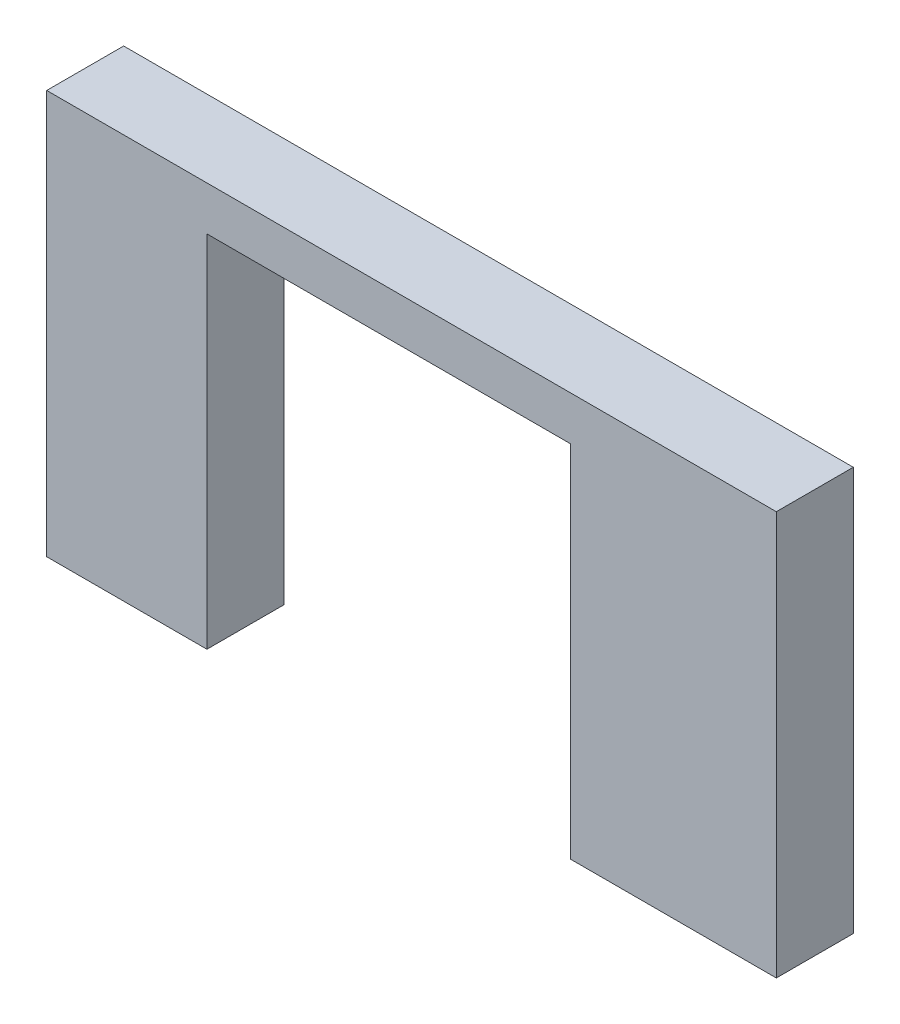
ISO-10303-21;
HEADER;
FILE_DESCRIPTION(('STEP AP214'),'2;1');
FILE_NAME('part.step','',(''),(''),'','','');
FILE_SCHEMA(('AUTOMOTIVE_DESIGN { 1 0 10303 214 1 1 1 1 }'));
ENDSEC;
DATA;
#1=APPLICATION_CONTEXT('core data for automotive mechanical design processes');
#2=APPLICATION_PROTOCOL_DEFINITION('international standard','automotive_design',2000,#1);
#3=PRODUCT_CONTEXT('',#1,'mechanical');
#4=PRODUCT('Part','Part','',(#3));
#5=PRODUCT_RELATED_PRODUCT_CATEGORY('part','',(#4));
#6=PRODUCT_DEFINITION_FORMATION('','',#4);
#7=PRODUCT_DEFINITION_CONTEXT('part definition',#1,'design');
#8=PRODUCT_DEFINITION('design','',#6,#7);
#9=PRODUCT_DEFINITION_SHAPE('','',#8);
#10=(LENGTH_UNIT() NAMED_UNIT(*) SI_UNIT(.MILLI.,.METRE.));
#11=(NAMED_UNIT(*) PLANE_ANGLE_UNIT() SI_UNIT($,.RADIAN.));
#12=(NAMED_UNIT(*) SI_UNIT($,.STERADIAN.) SOLID_ANGLE_UNIT());
#13=UNCERTAINTY_MEASURE_WITH_UNIT(LENGTH_MEASURE(1.E-05),#10,'distance_accuracy_value','');
#14=(GEOMETRIC_REPRESENTATION_CONTEXT(3) GLOBAL_UNCERTAINTY_ASSIGNED_CONTEXT((#13)) GLOBAL_UNIT_ASSIGNED_CONTEXT((#10,
#11,#12)) REPRESENTATION_CONTEXT('',''));
#15=CARTESIAN_POINT('',(0.,0.,0.));
#16=DIRECTION('',(0.,0.,1.));
#17=DIRECTION('',(1.,0.,0.));
#18=AXIS2_PLACEMENT_3D('',#15,#16,#17);
#19=CARTESIAN_POINT('',(0.,0.,3.175));
#20=DIRECTION('',(0.,1.,0.));
#21=DIRECTION('',(0.,0.,1.));
#22=AXIS2_PLACEMENT_3D('',#19,#20,#21);
#23=PLANE('',#22);
#24=DIRECTION('',(1.,0.,0.));
#25=VECTOR('',#24,1.);
#26=CARTESIAN_POINT('',(0.,0.,0.));
#27=LINE('',#26,#25);
#28=CARTESIAN_POINT('',(0.,0.,0.));
#29=VERTEX_POINT('',#28);
#30=CARTESIAN_POINT('',(6.61,0.,0.));
#31=VERTEX_POINT('',#30);
#32=EDGE_CURVE('E170',#29,#31,#27,.T.);
#33=ORIENTED_EDGE('',*,*,#32,.T.);
#34=DIRECTION('',(0.,0.,1.));
#35=VECTOR('',#34,1.);
#36=CARTESIAN_POINT('',(6.61,0.,3.175));
#37=LINE('',#36,#35);
#38=CARTESIAN_POINT('',(6.61,0.,3.175));
#39=VERTEX_POINT('',#38);
#40=EDGE_CURVE('E127',#31,#39,#37,.T.);
#41=ORIENTED_EDGE('',*,*,#40,.T.);
#42=DIRECTION('',(1.,0.,0.));
#43=VECTOR('',#42,1.);
#44=CARTESIAN_POINT('',(0.,0.,3.175));
#45=LINE('',#44,#43);
#46=CARTESIAN_POINT('',(0.,0.,3.175));
#47=VERTEX_POINT('',#46);
#48=EDGE_CURVE('E92',#47,#39,#45,.T.);
#49=ORIENTED_EDGE('',*,*,#48,.F.);
#50=DIRECTION('',(0.,0.,-1.));
#51=VECTOR('',#50,1.);
#52=CARTESIAN_POINT('',(0.,0.,3.175));
#53=LINE('',#52,#51);
#54=EDGE_CURVE('E47',#47,#29,#53,.T.);
#55=ORIENTED_EDGE('',*,*,#54,.T.);
#56=EDGE_LOOP('',(#33,#41,#49,#55));
#57=FACE_BOUND('',#56,.T.);
#58=ADVANCED_FACE('F38',(#57),#23,.F.);
#59=CARTESIAN_POINT('',(0.,0.,3.175));
#60=DIRECTION('',(1.,0.,0.));
#61=DIRECTION('',(0.,0.,-1.));
#62=AXIS2_PLACEMENT_3D('',#59,#60,#61);
#63=PLANE('',#62);
#64=DIRECTION('',(0.,-1.,0.));
#65=VECTOR('',#64,1.);
#66=CARTESIAN_POINT('',(0.,0.,0.));
#67=LINE('',#66,#65);
#68=CARTESIAN_POINT('',(0.,16.66,0.));
#69=VERTEX_POINT('',#68);
#70=EDGE_CURVE('E153',#69,#29,#67,.T.);
#71=ORIENTED_EDGE('',*,*,#70,.T.);
#72=ORIENTED_EDGE('',*,*,#54,.F.);
#73=DIRECTION('',(0.,-1.,0.));
#74=VECTOR('',#73,1.);
#75=CARTESIAN_POINT('',(0.,0.,3.175));
#76=LINE('',#75,#74);
#77=CARTESIAN_POINT('',(0.,16.66,3.175));
#78=VERTEX_POINT('',#77);
#79=EDGE_CURVE('E154',#78,#47,#76,.T.);
#80=ORIENTED_EDGE('',*,*,#79,.F.);
#81=DIRECTION('',(0.,0.,-1.));
#82=VECTOR('',#81,1.);
#83=CARTESIAN_POINT('',(0.,16.66,3.175));
#84=LINE('',#83,#82);
#85=EDGE_CURVE('E165',#78,#69,#84,.T.);
#86=ORIENTED_EDGE('',*,*,#85,.T.);
#87=EDGE_LOOP('',(#71,#72,#80,#86));
#88=FACE_BOUND('',#87,.T.);
#89=ADVANCED_FACE('F40',(#88),#63,.F.);
#90=CARTESIAN_POINT('',(21.61,0.,3.175));
#91=VERTEX_POINT('',#90);
#92=CARTESIAN_POINT('',(30.1,0.,3.175));
#93=VERTEX_POINT('',#92);
#94=EDGE_CURVE('E157',#91,#93,#45,.T.);
#95=ORIENTED_EDGE('',*,*,#94,.F.);
#96=DIRECTION('',(0.,0.,-1.));
#97=VECTOR('',#96,1.);
#98=CARTESIAN_POINT('',(21.61,0.,3.175));
#99=LINE('',#98,#97);
#100=CARTESIAN_POINT('',(21.61,0.,0.));
#101=VERTEX_POINT('',#100);
#102=EDGE_CURVE('E121',#91,#101,#99,.T.);
#103=ORIENTED_EDGE('',*,*,#102,.T.);
#104=CARTESIAN_POINT('',(30.1,0.,0.));
#105=VERTEX_POINT('',#104);
#106=EDGE_CURVE('E169',#101,#105,#27,.T.);
#107=ORIENTED_EDGE('',*,*,#106,.T.);
#108=DIRECTION('',(0.,0.,-1.));
#109=VECTOR('',#108,1.);
#110=CARTESIAN_POINT('',(30.1,0.,3.175));
#111=LINE('',#110,#109);
#112=EDGE_CURVE('E183',#93,#105,#111,.T.);
#113=ORIENTED_EDGE('',*,*,#112,.F.);
#114=EDGE_LOOP('',(#95,#103,#107,#113));
#115=FACE_BOUND('',#114,.T.);
#116=ADVANCED_FACE('F203',(#115),#23,.F.);
#117=CARTESIAN_POINT('',(30.1,0.,3.175));
#118=DIRECTION('',(-1.,0.,0.));
#119=DIRECTION('',(0.,0.,1.));
#120=AXIS2_PLACEMENT_3D('',#117,#118,#119);
#121=PLANE('',#120);
#122=DIRECTION('',(0.,1.,0.));
#123=VECTOR('',#122,1.);
#124=CARTESIAN_POINT('',(30.1,0.,0.));
#125=LINE('',#124,#123);
#126=CARTESIAN_POINT('',(30.1,16.66,0.));
#127=VERTEX_POINT('',#126);
#128=EDGE_CURVE('E173',#105,#127,#125,.T.);
#129=ORIENTED_EDGE('',*,*,#128,.T.);
#130=DIRECTION('',(0.,0.,-1.));
#131=VECTOR('',#130,1.);
#132=CARTESIAN_POINT('',(30.1,16.66,3.175));
#133=LINE('',#132,#131);
#134=CARTESIAN_POINT('',(30.1,16.66,3.175));
#135=VERTEX_POINT('',#134);
#136=EDGE_CURVE('E180',#135,#127,#133,.T.);
#137=ORIENTED_EDGE('',*,*,#136,.F.);
#138=DIRECTION('',(0.,1.,0.));
#139=VECTOR('',#138,1.);
#140=CARTESIAN_POINT('',(30.1,0.,3.175));
#141=LINE('',#140,#139);
#142=EDGE_CURVE('E160',#93,#135,#141,.T.);
#143=ORIENTED_EDGE('',*,*,#142,.F.);
#144=ORIENTED_EDGE('',*,*,#112,.T.);
#145=EDGE_LOOP('',(#129,#137,#143,#144));
#146=FACE_BOUND('',#145,.T.);
#147=ADVANCED_FACE('F194',(#146),#121,.F.);
#148=CARTESIAN_POINT('',(0.,16.66,3.175));
#149=DIRECTION('',(0.,-1.,0.));
#150=DIRECTION('',(0.,0.,-1.));
#151=AXIS2_PLACEMENT_3D('',#148,#149,#150);
#152=PLANE('',#151);
#153=DIRECTION('',(-1.,0.,0.));
#154=VECTOR('',#153,1.);
#155=CARTESIAN_POINT('',(0.,16.66,0.));
#156=LINE('',#155,#154);
#157=EDGE_CURVE('E84',#127,#69,#156,.T.);
#158=ORIENTED_EDGE('',*,*,#157,.T.);
#159=ORIENTED_EDGE('',*,*,#85,.F.);
#160=DIRECTION('',(-1.,0.,0.));
#161=VECTOR('',#160,1.);
#162=CARTESIAN_POINT('',(0.,16.66,3.175));
#163=LINE('',#162,#161);
#164=EDGE_CURVE('E63',#135,#78,#163,.T.);
#165=ORIENTED_EDGE('',*,*,#164,.F.);
#166=ORIENTED_EDGE('',*,*,#136,.T.);
#167=EDGE_LOOP('',(#158,#159,#165,#166));
#168=FACE_BOUND('',#167,.T.);
#169=ADVANCED_FACE('F197',(#168),#152,.F.);
#170=CARTESIAN_POINT('',(0.,0.,3.175));
#171=DIRECTION('',(0.,0.,-1.));
#172=DIRECTION('',(-1.,0.,0.));
#173=AXIS2_PLACEMENT_3D('',#170,#171,#172);
#174=PLANE('',#173);
#175=ORIENTED_EDGE('',*,*,#48,.T.);
#176=DIRECTION('',(0.,-1.,0.));
#177=VECTOR('',#176,1.);
#178=CARTESIAN_POINT('',(6.61,14.84,3.175));
#179=LINE('',#178,#177);
#180=CARTESIAN_POINT('',(6.61,14.84,3.175));
#181=VERTEX_POINT('',#180);
#182=EDGE_CURVE('E140',#181,#39,#179,.T.);
#183=ORIENTED_EDGE('',*,*,#182,.F.);
#184=DIRECTION('',(-1.,0.,0.));
#185=VECTOR('',#184,1.);
#186=CARTESIAN_POINT('',(6.61,14.84,3.175));
#187=LINE('',#186,#185);
#188=CARTESIAN_POINT('',(21.61,14.84,3.175));
#189=VERTEX_POINT('',#188);
#190=EDGE_CURVE('E117',#189,#181,#187,.T.);
#191=ORIENTED_EDGE('',*,*,#190,.F.);
#192=DIRECTION('',(0.,1.,0.));
#193=VECTOR('',#192,1.);
#194=CARTESIAN_POINT('',(21.61,14.84,3.175));
#195=LINE('',#194,#193);
#196=EDGE_CURVE('E143',#91,#189,#195,.T.);
#197=ORIENTED_EDGE('',*,*,#196,.F.);
#198=ORIENTED_EDGE('',*,*,#94,.T.);
#199=ORIENTED_EDGE('',*,*,#142,.T.);
#200=ORIENTED_EDGE('',*,*,#164,.T.);
#201=ORIENTED_EDGE('',*,*,#79,.T.);
#202=EDGE_LOOP('',(#175,#183,#191,#197,#198,#199,#200,#201));
#203=FACE_BOUND('',#202,.T.);
#204=ADVANCED_FACE('F198',(#203),#174,.F.);
#205=CARTESIAN_POINT('',(0.,0.,0.));
#206=DIRECTION('',(0.,0.,-1.));
#207=DIRECTION('',(-1.,0.,0.));
#208=AXIS2_PLACEMENT_3D('',#205,#206,#207);
#209=PLANE('',#208);
#210=DIRECTION('',(0.,-1.,0.));
#211=VECTOR('',#210,1.);
#212=CARTESIAN_POINT('',(6.61,14.84,0.));
#213=LINE('',#212,#211);
#214=CARTESIAN_POINT('',(6.61,14.84,0.));
#215=VERTEX_POINT('',#214);
#216=EDGE_CURVE('E125',#215,#31,#213,.T.);
#217=ORIENTED_EDGE('',*,*,#216,.T.);
#218=ORIENTED_EDGE('',*,*,#32,.F.);
#219=ORIENTED_EDGE('',*,*,#70,.F.);
#220=ORIENTED_EDGE('',*,*,#157,.F.);
#221=ORIENTED_EDGE('',*,*,#128,.F.);
#222=ORIENTED_EDGE('',*,*,#106,.F.);
#223=DIRECTION('',(0.,-1.,0.));
#224=VECTOR('',#223,1.);
#225=CARTESIAN_POINT('',(21.61,0.,0.));
#226=LINE('',#225,#224);
#227=CARTESIAN_POINT('',(21.61,14.84,0.));
#228=VERTEX_POINT('',#227);
#229=EDGE_CURVE('E11',#228,#101,#226,.T.);
#230=ORIENTED_EDGE('',*,*,#229,.F.);
#231=DIRECTION('',(-1.,0.,0.));
#232=VECTOR('',#231,1.);
#233=CARTESIAN_POINT('',(6.61,14.84,0.));
#234=LINE('',#233,#232);
#235=EDGE_CURVE('E54',#228,#215,#234,.T.);
#236=ORIENTED_EDGE('',*,*,#235,.T.);
#237=EDGE_LOOP('',(#217,#218,#219,#220,#221,#222,#230,#236));
#238=FACE_BOUND('',#237,.T.);
#239=ADVANCED_FACE('F133',(#238),#209,.T.);
#240=CARTESIAN_POINT('',(6.61,14.84,0.));
#241=DIRECTION('',(-1.,0.,0.));
#242=DIRECTION('',(0.,-1.,0.));
#243=AXIS2_PLACEMENT_3D('',#240,#241,#242);
#244=PLANE('',#243);
#245=ORIENTED_EDGE('',*,*,#216,.F.);
#246=DIRECTION('',(0.,0.,1.));
#247=VECTOR('',#246,1.);
#248=CARTESIAN_POINT('',(6.61,14.84,0.));
#249=LINE('',#248,#247);
#250=EDGE_CURVE('E113',#215,#181,#249,.T.);
#251=ORIENTED_EDGE('',*,*,#250,.T.);
#252=ORIENTED_EDGE('',*,*,#182,.T.);
#253=ORIENTED_EDGE('',*,*,#40,.F.);
#254=EDGE_LOOP('',(#245,#251,#252,#253));
#255=FACE_BOUND('',#254,.T.);
#256=ADVANCED_FACE('F126',(#255),#244,.F.);
#257=CARTESIAN_POINT('',(21.61,14.84,0.));
#258=DIRECTION('',(1.,0.,0.));
#259=DIRECTION('',(0.,1.,0.));
#260=AXIS2_PLACEMENT_3D('',#257,#258,#259);
#261=PLANE('',#260);
#262=ORIENTED_EDGE('',*,*,#196,.T.);
#263=DIRECTION('',(0.,0.,1.));
#264=VECTOR('',#263,1.);
#265=CARTESIAN_POINT('',(21.61,14.84,0.));
#266=LINE('',#265,#264);
#267=EDGE_CURVE('E122',#228,#189,#266,.T.);
#268=ORIENTED_EDGE('',*,*,#267,.F.);
#269=ORIENTED_EDGE('',*,*,#229,.T.);
#270=ORIENTED_EDGE('',*,*,#102,.F.);
#271=EDGE_LOOP('',(#262,#268,#269,#270));
#272=FACE_BOUND('',#271,.T.);
#273=ADVANCED_FACE('F206',(#272),#261,.F.);
#274=CARTESIAN_POINT('',(6.61,14.84,0.));
#275=DIRECTION('',(0.,1.,0.));
#276=DIRECTION('',(0.,0.,1.));
#277=AXIS2_PLACEMENT_3D('',#274,#275,#276);
#278=PLANE('',#277);
#279=ORIENTED_EDGE('',*,*,#190,.T.);
#280=ORIENTED_EDGE('',*,*,#250,.F.);
#281=ORIENTED_EDGE('',*,*,#235,.F.);
#282=ORIENTED_EDGE('',*,*,#267,.T.);
#283=EDGE_LOOP('',(#279,#280,#281,#282));
#284=FACE_BOUND('',#283,.T.);
#285=ADVANCED_FACE('F115',(#284),#278,.F.);
#286=CLOSED_SHELL('',(#58,#89,#116,#147,#169,#204,#239,#256,#273,#285));
#287=MANIFOLD_SOLID_BREP('B2',#286);
#288=ADVANCED_BREP_SHAPE_REPRESENTATION('',(#18,#287),#14);
#289=SHAPE_DEFINITION_REPRESENTATION(#9,#288);
ENDSEC;
END-ISO-10303-21;
